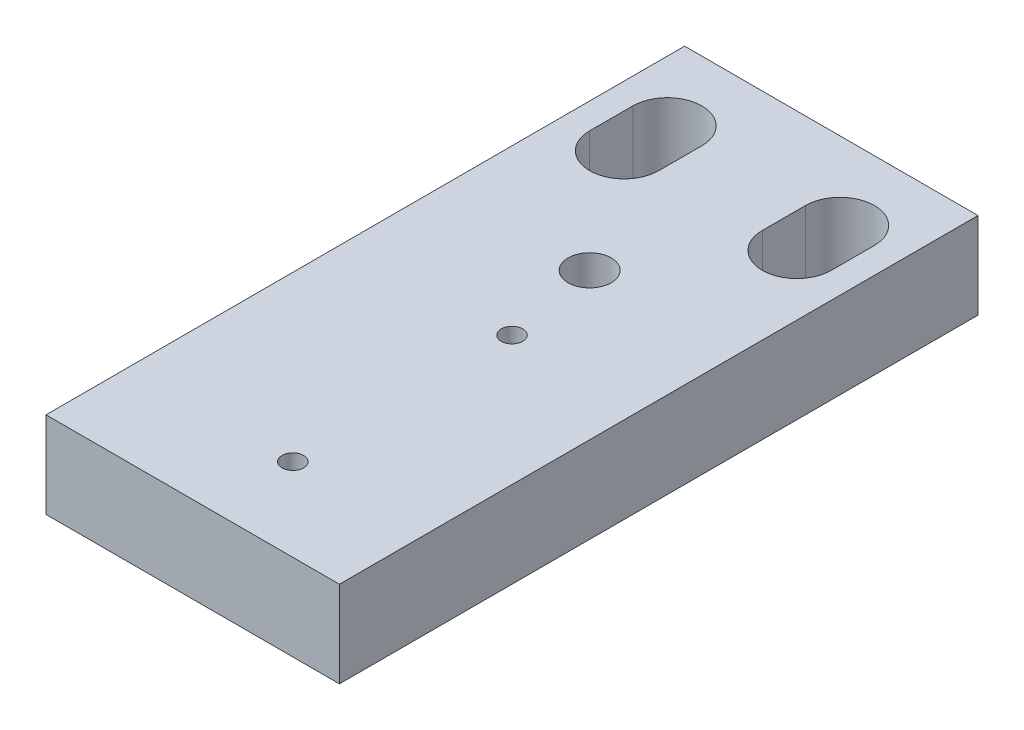
ISO-10303-21;
HEADER;
FILE_DESCRIPTION(('STEP AP214'),'2;1');
FILE_NAME('part.step','',(''),(''),'','','');
FILE_SCHEMA(('AUTOMOTIVE_DESIGN { 1 0 10303 214 1 1 1 1 }'));
ENDSEC;
DATA;
#1=APPLICATION_CONTEXT('core data for automotive mechanical design processes');
#2=APPLICATION_PROTOCOL_DEFINITION('international standard','automotive_design',2000,#1);
#3=PRODUCT_CONTEXT('',#1,'mechanical');
#4=PRODUCT('Part','Part','',(#3));
#5=PRODUCT_RELATED_PRODUCT_CATEGORY('part','',(#4));
#6=PRODUCT_DEFINITION_FORMATION('','',#4);
#7=PRODUCT_DEFINITION_CONTEXT('part definition',#1,'design');
#8=PRODUCT_DEFINITION('design','',#6,#7);
#9=PRODUCT_DEFINITION_SHAPE('','',#8);
#10=(LENGTH_UNIT() NAMED_UNIT(*) SI_UNIT(.MILLI.,.METRE.));
#11=(NAMED_UNIT(*) PLANE_ANGLE_UNIT() SI_UNIT($,.RADIAN.));
#12=(NAMED_UNIT(*) SI_UNIT($,.STERADIAN.) SOLID_ANGLE_UNIT());
#13=UNCERTAINTY_MEASURE_WITH_UNIT(LENGTH_MEASURE(1.E-05),#10,'distance_accuracy_value','');
#14=(GEOMETRIC_REPRESENTATION_CONTEXT(3) GLOBAL_UNCERTAINTY_ASSIGNED_CONTEXT((#13)) GLOBAL_UNIT_ASSIGNED_CONTEXT((#10,
#11,#12)) REPRESENTATION_CONTEXT('',''));
#15=CARTESIAN_POINT('',(0.,0.,0.));
#16=DIRECTION('',(0.,0.,1.));
#17=DIRECTION('',(1.,0.,0.));
#18=AXIS2_PLACEMENT_3D('',#15,#16,#17);
#19=CARTESIAN_POINT('',(0.,10.,0.));
#20=DIRECTION('',(0.,1.,0.));
#21=DIRECTION('',(0.,0.,1.));
#22=AXIS2_PLACEMENT_3D('',#19,#20,#21);
#23=PLANE('',#22);
#24=CARTESIAN_POINT('',(0.,10.,-8.99999999999943));
#25=DIRECTION('',(0.,-1.,0.));
#26=DIRECTION('',(0.,0.,-1.));
#27=AXIS2_PLACEMENT_3D('',#24,#25,#26);
#28=CIRCLE('',#27,2.5);
#29=CARTESIAN_POINT('',(0.,10.,-11.4999999999994));
#30=VERTEX_POINT('',#29);
#31=EDGE_CURVE('P0_E169',#30,#30,#28,.T.);
#32=ORIENTED_EDGE('',*,*,#31,.T.);
#33=EDGE_LOOP('',(#32));
#34=FACE_BOUND('',#33,.T.);
#35=CARTESIAN_POINT('',(2.,10.,2.));
#36=DIRECTION('',(0.,1.,0.));
#37=DIRECTION('',(0.,0.,1.));
#38=AXIS2_PLACEMENT_3D('',#35,#36,#37);
#39=CIRCLE('',#38,1.25);
#40=CARTESIAN_POINT('',(2.,10.,3.25));
#41=VERTEX_POINT('',#40);
#42=EDGE_CURVE('P0_E172',#41,#41,#39,.F.);
#43=ORIENTED_EDGE('',*,*,#42,.T.);
#44=EDGE_LOOP('',(#43));
#45=FACE_BOUND('',#44,.T.);
#46=CARTESIAN_POINT('',(2.,10.,27.4));
#47=DIRECTION('',(0.,1.,0.));
#48=DIRECTION('',(0.,0.,1.));
#49=AXIS2_PLACEMENT_3D('',#46,#47,#48);
#50=CIRCLE('',#49,1.25);
#51=CARTESIAN_POINT('',(2.,10.,28.65));
#52=VERTEX_POINT('',#51);
#53=EDGE_CURVE('P0_E175',#52,#52,#50,.F.);
#54=ORIENTED_EDGE('',*,*,#53,.T.);
#55=EDGE_LOOP('',(#54));
#56=FACE_BOUND('',#55,.T.);
#57=CARTESIAN_POINT('',(10.,10.,-22.9999999999994));
#58=DIRECTION('',(0.,1.,0.));
#59=DIRECTION('',(0.,0.,1.));
#60=AXIS2_PLACEMENT_3D('',#57,#58,#59);
#61=CIRCLE('',#60,4.);
#62=CARTESIAN_POINT('',(14.,10.,-22.9999999999994));
#63=VERTEX_POINT('',#62);
#64=CARTESIAN_POINT('',(6.00000000000001,10.,-22.9999999999994));
#65=VERTEX_POINT('',#64);
#66=EDGE_CURVE('P0_E179',#63,#65,#61,.F.);
#67=ORIENTED_EDGE('',*,*,#66,.T.);
#68=DIRECTION('',(0.,0.,-1.));
#69=VECTOR('',#68,1.);
#70=CARTESIAN_POINT('',(6.00000000000001,10.,-22.9999999999994));
#71=LINE('',#70,#69);
#72=CARTESIAN_POINT('',(6.00000000000001,10.,-27.9999999999994));
#73=VERTEX_POINT('',#72);
#74=EDGE_CURVE('P0_E135',#73,#65,#71,.F.);
#75=ORIENTED_EDGE('',*,*,#74,.F.);
#76=CARTESIAN_POINT('',(10.,10.,-27.9999999999994));
#77=DIRECTION('',(0.,1.,0.));
#78=DIRECTION('',(0.,0.,1.));
#79=AXIS2_PLACEMENT_3D('',#76,#77,#78);
#80=CIRCLE('',#79,4.);
#81=CARTESIAN_POINT('',(14.,10.,-27.9999999999994));
#82=VERTEX_POINT('',#81);
#83=EDGE_CURVE('P0_E142',#73,#82,#80,.F.);
#84=ORIENTED_EDGE('',*,*,#83,.T.);
#85=DIRECTION('',(0.,0.,1.));
#86=VECTOR('',#85,1.);
#87=CARTESIAN_POINT('',(14.,10.,-27.9999999999994));
#88=LINE('',#87,#86);
#89=EDGE_CURVE('P0_E139',#63,#82,#88,.F.);
#90=ORIENTED_EDGE('',*,*,#89,.F.);
#91=EDGE_LOOP('',(#67,#75,#84,#90));
#92=FACE_BOUND('',#91,.T.);
#93=CARTESIAN_POINT('',(-10.,10.,-27.9999999999994));
#94=DIRECTION('',(0.,1.,0.));
#95=DIRECTION('',(0.,0.,1.));
#96=AXIS2_PLACEMENT_3D('',#93,#94,#95);
#97=CIRCLE('',#96,4.);
#98=CARTESIAN_POINT('',(-14.,10.,-27.9999999999994));
#99=VERTEX_POINT('',#98);
#100=CARTESIAN_POINT('',(-6.00000000000001,10.,-27.9999999999994));
#101=VERTEX_POINT('',#100);
#102=EDGE_CURVE('P0_E183',#99,#101,#97,.F.);
#103=ORIENTED_EDGE('',*,*,#102,.T.);
#104=DIRECTION('',(0.,0.,1.));
#105=VECTOR('',#104,1.);
#106=CARTESIAN_POINT('',(-6.00000000000001,10.,-27.9999999999994));
#107=LINE('',#106,#105);
#108=CARTESIAN_POINT('',(-6.00000000000001,10.,-22.9999999999994));
#109=VERTEX_POINT('',#108);
#110=EDGE_CURVE('P0_E85',#109,#101,#107,.F.);
#111=ORIENTED_EDGE('',*,*,#110,.F.);
#112=CARTESIAN_POINT('',(-10.,10.,-22.9999999999994));
#113=DIRECTION('',(0.,1.,0.));
#114=DIRECTION('',(0.,0.,1.));
#115=AXIS2_PLACEMENT_3D('',#112,#113,#114);
#116=CIRCLE('',#115,4.);
#117=CARTESIAN_POINT('',(-14.,10.,-22.9999999999994));
#118=VERTEX_POINT('',#117);
#119=EDGE_CURVE('P0_E19',#109,#118,#116,.F.);
#120=ORIENTED_EDGE('',*,*,#119,.T.);
#121=DIRECTION('',(0.,0.,-1.));
#122=VECTOR('',#121,1.);
#123=CARTESIAN_POINT('',(-14.,10.,-22.9999999999994));
#124=LINE('',#123,#122);
#125=EDGE_CURVE('P0_E146',#99,#118,#124,.F.);
#126=ORIENTED_EDGE('',*,*,#125,.F.);
#127=EDGE_LOOP('',(#103,#111,#120,#126));
#128=FACE_BOUND('',#127,.T.);
#129=DIRECTION('',(-1.,0.,0.));
#130=VECTOR('',#129,1.);
#131=CARTESIAN_POINT('',(17.,10.,-36.9999999999994));
#132=LINE('',#131,#130);
#133=CARTESIAN_POINT('',(-17.,10.,-36.9999999999994));
#134=VERTEX_POINT('',#133);
#135=CARTESIAN_POINT('',(17.,10.,-36.9999999999994));
#136=VERTEX_POINT('',#135);
#137=EDGE_CURVE('P0_E95',#134,#136,#132,.F.);
#138=ORIENTED_EDGE('',*,*,#137,.F.);
#139=DIRECTION('',(0.,0.,1.));
#140=VECTOR('',#139,1.);
#141=CARTESIAN_POINT('',(-17.,10.,-36.9999999999994));
#142=LINE('',#141,#140);
#143=CARTESIAN_POINT('',(-17.,10.,37.));
#144=VERTEX_POINT('',#143);
#145=EDGE_CURVE('P0_E122',#144,#134,#142,.F.);
#146=ORIENTED_EDGE('',*,*,#145,.F.);
#147=DIRECTION('',(1.,0.,0.));
#148=VECTOR('',#147,1.);
#149=CARTESIAN_POINT('',(-17.,10.,37.));
#150=LINE('',#149,#148);
#151=CARTESIAN_POINT('',(17.,10.,37.0000000000011));
#152=VERTEX_POINT('',#151);
#153=EDGE_CURVE('P0_E113',#152,#144,#150,.F.);
#154=ORIENTED_EDGE('',*,*,#153,.F.);
#155=DIRECTION('',(0.,0.,-1.));
#156=VECTOR('',#155,1.);
#157=CARTESIAN_POINT('',(17.,10.,37.0000000000011));
#158=LINE('',#157,#156);
#159=EDGE_CURVE('P0_E107',#136,#152,#158,.F.);
#160=ORIENTED_EDGE('',*,*,#159,.F.);
#161=EDGE_LOOP('',(#138,#146,#154,#160));
#162=FACE_BOUND('',#161,.T.);
#163=ADVANCED_FACE('P0_F16',(#34,#45,#56,#92,#128,#162),#23,.T.);
#164=CARTESIAN_POINT('',(-17.,0.,-36.9999999999994));
#165=DIRECTION('',(-1.,0.,0.));
#166=DIRECTION('',(0.,0.,1.));
#167=AXIS2_PLACEMENT_3D('',#164,#165,#166);
#168=PLANE('',#167);
#169=DIRECTION('',(0.,1.,0.));
#170=VECTOR('',#169,1.);
#171=CARTESIAN_POINT('',(-17.,0.,-36.9999999999994));
#172=LINE('',#171,#170);
#173=CARTESIAN_POINT('',(-17.,0.,-36.9999999999994));
#174=VERTEX_POINT('',#173);
#175=EDGE_CURVE('P0_E199',#174,#134,#172,.T.);
#176=ORIENTED_EDGE('',*,*,#175,.F.);
#177=DIRECTION('',(0.,0.,1.));
#178=VECTOR('',#177,1.);
#179=CARTESIAN_POINT('',(-17.,0.,0.));
#180=LINE('',#179,#178);
#181=CARTESIAN_POINT('',(-17.,0.,37.));
#182=VERTEX_POINT('',#181);
#183=EDGE_CURVE('P0_E130',#174,#182,#180,.T.);
#184=ORIENTED_EDGE('',*,*,#183,.T.);
#185=DIRECTION('',(0.,1.,0.));
#186=VECTOR('',#185,1.);
#187=CARTESIAN_POINT('',(-17.,0.,37.));
#188=LINE('',#187,#186);
#189=EDGE_CURVE('P0_E118',#144,#182,#188,.F.);
#190=ORIENTED_EDGE('',*,*,#189,.F.);
#191=ORIENTED_EDGE('',*,*,#145,.T.);
#192=EDGE_LOOP('',(#176,#184,#190,#191));
#193=FACE_BOUND('',#192,.T.);
#194=ADVANCED_FACE('P0_F128',(#193),#168,.T.);
#195=CARTESIAN_POINT('',(-17.,0.,37.));
#196=DIRECTION('',(0.,0.,1.));
#197=DIRECTION('',(1.,0.,0.));
#198=AXIS2_PLACEMENT_3D('',#195,#196,#197);
#199=PLANE('',#198);
#200=ORIENTED_EDGE('',*,*,#189,.T.);
#201=DIRECTION('',(1.,0.,0.));
#202=VECTOR('',#201,1.);
#203=CARTESIAN_POINT('',(0.,0.,37.));
#204=LINE('',#203,#202);
#205=CARTESIAN_POINT('',(17.,0.,37.0000000000011));
#206=VERTEX_POINT('',#205);
#207=EDGE_CURVE('P0_E209',#182,#206,#204,.T.);
#208=ORIENTED_EDGE('',*,*,#207,.T.);
#209=DIRECTION('',(0.,1.,0.));
#210=VECTOR('',#209,1.);
#211=CARTESIAN_POINT('',(17.,0.,37.0000000000011));
#212=LINE('',#211,#210);
#213=EDGE_CURVE('P0_E120',#152,#206,#212,.F.);
#214=ORIENTED_EDGE('',*,*,#213,.F.);
#215=ORIENTED_EDGE('',*,*,#153,.T.);
#216=EDGE_LOOP('',(#200,#208,#214,#215));
#217=FACE_BOUND('',#216,.T.);
#218=ADVANCED_FACE('P0_F115',(#217),#199,.T.);
#219=CARTESIAN_POINT('',(17.,0.,37.0000000000011));
#220=DIRECTION('',(1.,0.,0.));
#221=DIRECTION('',(0.,0.,-1.));
#222=AXIS2_PLACEMENT_3D('',#219,#220,#221);
#223=PLANE('',#222);
#224=ORIENTED_EDGE('',*,*,#213,.T.);
#225=DIRECTION('',(0.,0.,1.));
#226=VECTOR('',#225,1.);
#227=CARTESIAN_POINT('',(17.,0.,1.13797860024079E-12));
#228=LINE('',#227,#226);
#229=CARTESIAN_POINT('',(17.,0.,-36.9999999999994));
#230=VERTEX_POINT('',#229);
#231=EDGE_CURVE('P0_E204',#206,#230,#228,.F.);
#232=ORIENTED_EDGE('',*,*,#231,.T.);
#233=DIRECTION('',(0.,1.,0.));
#234=VECTOR('',#233,1.);
#235=CARTESIAN_POINT('',(17.,0.,-36.9999999999994));
#236=LINE('',#235,#234);
#237=EDGE_CURVE('P0_E145',#136,#230,#236,.F.);
#238=ORIENTED_EDGE('',*,*,#237,.F.);
#239=ORIENTED_EDGE('',*,*,#159,.T.);
#240=EDGE_LOOP('',(#224,#232,#238,#239));
#241=FACE_BOUND('',#240,.T.);
#242=ADVANCED_FACE('P0_F203',(#241),#223,.T.);
#243=CARTESIAN_POINT('',(17.,0.,-36.9999999999994));
#244=DIRECTION('',(0.,0.,-1.));
#245=DIRECTION('',(-1.,0.,0.));
#246=AXIS2_PLACEMENT_3D('',#243,#244,#245);
#247=PLANE('',#246);
#248=ORIENTED_EDGE('',*,*,#237,.T.);
#249=DIRECTION('',(1.,0.,0.));
#250=VECTOR('',#249,1.);
#251=CARTESIAN_POINT('',(0.,0.,-36.9999999999994));
#252=LINE('',#251,#250);
#253=EDGE_CURVE('P0_E211',#230,#174,#252,.F.);
#254=ORIENTED_EDGE('',*,*,#253,.T.);
#255=ORIENTED_EDGE('',*,*,#175,.T.);
#256=ORIENTED_EDGE('',*,*,#137,.T.);
#257=EDGE_LOOP('',(#248,#254,#255,#256));
#258=FACE_BOUND('',#257,.T.);
#259=ADVANCED_FACE('P0_F240',(#258),#247,.T.);
#260=CARTESIAN_POINT('',(-6.00000000000001,0.,-27.9999999999994));
#261=DIRECTION('',(-1.,0.,0.));
#262=DIRECTION('',(0.,0.,1.));
#263=AXIS2_PLACEMENT_3D('',#260,#261,#262);
#264=PLANE('',#263);
#265=DIRECTION('',(0.,1.,0.));
#266=VECTOR('',#265,1.);
#267=CARTESIAN_POINT('',(-6.00000000000001,0.,-27.9999999999994));
#268=LINE('',#267,#266);
#269=CARTESIAN_POINT('',(-6.00000000000001,0.,-27.9999999999994));
#270=VERTEX_POINT('',#269);
#271=EDGE_CURVE('P0_E138',#101,#270,#268,.F.);
#272=ORIENTED_EDGE('',*,*,#271,.T.);
#273=DIRECTION('',(0.,0.,1.));
#274=VECTOR('',#273,1.);
#275=CARTESIAN_POINT('',(-6.00000000000001,0.,0.));
#276=LINE('',#275,#274);
#277=CARTESIAN_POINT('',(-6.00000000000001,0.,-22.9999999999994));
#278=VERTEX_POINT('',#277);
#279=EDGE_CURVE('P0_E168',#270,#278,#276,.T.);
#280=ORIENTED_EDGE('',*,*,#279,.T.);
#281=DIRECTION('',(0.,1.,0.));
#282=VECTOR('',#281,1.);
#283=CARTESIAN_POINT('',(-6.00000000000001,0.,-22.9999999999994));
#284=LINE('',#283,#282);
#285=EDGE_CURVE('P0_E144',#278,#109,#284,.T.);
#286=ORIENTED_EDGE('',*,*,#285,.T.);
#287=ORIENTED_EDGE('',*,*,#110,.T.);
#288=EDGE_LOOP('',(#272,#280,#286,#287));
#289=FACE_BOUND('',#288,.T.);
#290=ADVANCED_FACE('P0_F243',(#289),#264,.T.);
#291=CARTESIAN_POINT('',(-10.,0.,-22.9999999999994));
#292=DIRECTION('',(0.,1.,0.));
#293=DIRECTION('',(0.,0.,1.));
#294=AXIS2_PLACEMENT_3D('',#291,#292,#293);
#295=CYLINDRICAL_SURFACE('',#294,4.);
#296=ORIENTED_EDGE('',*,*,#119,.F.);
#297=ORIENTED_EDGE('',*,*,#285,.F.);
#298=CARTESIAN_POINT('',(-10.,0.,-22.9999999999994));
#299=DIRECTION('',(0.,1.,0.));
#300=DIRECTION('',(0.,0.,1.));
#301=AXIS2_PLACEMENT_3D('',#298,#299,#300);
#302=CIRCLE('',#301,4.);
#303=CARTESIAN_POINT('',(-14.,0.,-22.9999999999994));
#304=VERTEX_POINT('',#303);
#305=EDGE_CURVE('P0_E165',#278,#304,#302,.F.);
#306=ORIENTED_EDGE('',*,*,#305,.T.);
#307=DIRECTION('',(0.,1.,0.));
#308=VECTOR('',#307,1.);
#309=CARTESIAN_POINT('',(-14.,0.,-22.9999999999994));
#310=LINE('',#309,#308);
#311=EDGE_CURVE('P0_E147',#118,#304,#310,.F.);
#312=ORIENTED_EDGE('',*,*,#311,.F.);
#313=EDGE_LOOP('',(#296,#297,#306,#312));
#314=FACE_BOUND('',#313,.T.);
#315=ADVANCED_FACE('P0_F250',(#314),#295,.F.);
#316=CARTESIAN_POINT('',(-14.,0.,-22.9999999999994));
#317=DIRECTION('',(1.,0.,0.));
#318=DIRECTION('',(0.,0.,-1.));
#319=AXIS2_PLACEMENT_3D('',#316,#317,#318);
#320=PLANE('',#319);
#321=ORIENTED_EDGE('',*,*,#311,.T.);
#322=DIRECTION('',(0.,0.,1.));
#323=VECTOR('',#322,1.);
#324=CARTESIAN_POINT('',(-14.,0.,0.));
#325=LINE('',#324,#323);
#326=CARTESIAN_POINT('',(-14.,0.,-27.9999999999994));
#327=VERTEX_POINT('',#326);
#328=EDGE_CURVE('P0_E164',#304,#327,#325,.F.);
#329=ORIENTED_EDGE('',*,*,#328,.T.);
#330=DIRECTION('',(0.,1.,0.));
#331=VECTOR('',#330,1.);
#332=CARTESIAN_POINT('',(-14.,0.,-27.9999999999994));
#333=LINE('',#332,#331);
#334=EDGE_CURVE('P0_E184',#327,#99,#333,.T.);
#335=ORIENTED_EDGE('',*,*,#334,.T.);
#336=ORIENTED_EDGE('',*,*,#125,.T.);
#337=EDGE_LOOP('',(#321,#329,#335,#336));
#338=FACE_BOUND('',#337,.T.);
#339=ADVANCED_FACE('P0_F287',(#338),#320,.T.);
#340=CARTESIAN_POINT('',(-10.,0.,-27.9999999999994));
#341=DIRECTION('',(0.,1.,0.));
#342=DIRECTION('',(0.,0.,1.));
#343=AXIS2_PLACEMENT_3D('',#340,#341,#342);
#344=CYLINDRICAL_SURFACE('',#343,4.);
#345=ORIENTED_EDGE('',*,*,#102,.F.);
#346=ORIENTED_EDGE('',*,*,#334,.F.);
#347=CARTESIAN_POINT('',(-10.,0.,-27.9999999999994));
#348=DIRECTION('',(0.,1.,0.));
#349=DIRECTION('',(0.,0.,1.));
#350=AXIS2_PLACEMENT_3D('',#347,#348,#349);
#351=CIRCLE('',#350,4.);
#352=EDGE_CURVE('P0_E161',#327,#270,#351,.F.);
#353=ORIENTED_EDGE('',*,*,#352,.T.);
#354=ORIENTED_EDGE('',*,*,#271,.F.);
#355=EDGE_LOOP('',(#345,#346,#353,#354));
#356=FACE_BOUND('',#355,.T.);
#357=ADVANCED_FACE('P0_F284',(#356),#344,.F.);
#358=CARTESIAN_POINT('',(6.00000000000001,0.,-22.9999999999994));
#359=DIRECTION('',(1.,0.,0.));
#360=DIRECTION('',(0.,0.,-1.));
#361=AXIS2_PLACEMENT_3D('',#358,#359,#360);
#362=PLANE('',#361);
#363=DIRECTION('',(0.,1.,0.));
#364=VECTOR('',#363,1.);
#365=CARTESIAN_POINT('',(6.00000000000001,0.,-22.9999999999994));
#366=LINE('',#365,#364);
#367=CARTESIAN_POINT('',(6.00000000000001,0.,-22.9999999999994));
#368=VERTEX_POINT('',#367);
#369=EDGE_CURVE('P0_E178',#65,#368,#366,.F.);
#370=ORIENTED_EDGE('',*,*,#369,.T.);
#371=DIRECTION('',(0.,0.,1.));
#372=VECTOR('',#371,1.);
#373=CARTESIAN_POINT('',(6.00000000000001,0.,0.));
#374=LINE('',#373,#372);
#375=CARTESIAN_POINT('',(6.00000000000001,0.,-27.9999999999994));
#376=VERTEX_POINT('',#375);
#377=EDGE_CURVE('P0_E160',#368,#376,#374,.F.);
#378=ORIENTED_EDGE('',*,*,#377,.T.);
#379=DIRECTION('',(0.,1.,0.));
#380=VECTOR('',#379,1.);
#381=CARTESIAN_POINT('',(6.00000000000001,0.,-27.9999999999994));
#382=LINE('',#381,#380);
#383=EDGE_CURVE('P0_E137',#376,#73,#382,.T.);
#384=ORIENTED_EDGE('',*,*,#383,.T.);
#385=ORIENTED_EDGE('',*,*,#74,.T.);
#386=EDGE_LOOP('',(#370,#378,#384,#385));
#387=FACE_BOUND('',#386,.T.);
#388=ADVANCED_FACE('P0_F223',(#387),#362,.T.);
#389=CARTESIAN_POINT('',(10.,0.,-27.9999999999994));
#390=DIRECTION('',(0.,1.,0.));
#391=DIRECTION('',(0.,0.,1.));
#392=AXIS2_PLACEMENT_3D('',#389,#390,#391);
#393=CYLINDRICAL_SURFACE('',#392,4.);
#394=ORIENTED_EDGE('',*,*,#83,.F.);
#395=ORIENTED_EDGE('',*,*,#383,.F.);
#396=CARTESIAN_POINT('',(10.,0.,-27.9999999999994));
#397=DIRECTION('',(0.,1.,0.));
#398=DIRECTION('',(0.,0.,1.));
#399=AXIS2_PLACEMENT_3D('',#396,#397,#398);
#400=CIRCLE('',#399,4.);
#401=CARTESIAN_POINT('',(14.,0.,-27.9999999999994));
#402=VERTEX_POINT('',#401);
#403=EDGE_CURVE('P0_E157',#376,#402,#400,.F.);
#404=ORIENTED_EDGE('',*,*,#403,.T.);
#405=DIRECTION('',(0.,1.,0.));
#406=VECTOR('',#405,1.);
#407=CARTESIAN_POINT('',(14.,0.,-27.9999999999994));
#408=LINE('',#407,#406);
#409=EDGE_CURVE('P0_E141',#82,#402,#408,.F.);
#410=ORIENTED_EDGE('',*,*,#409,.F.);
#411=EDGE_LOOP('',(#394,#395,#404,#410));
#412=FACE_BOUND('',#411,.T.);
#413=ADVANCED_FACE('P0_F228',(#412),#393,.F.);
#414=CARTESIAN_POINT('',(14.,0.,-27.9999999999994));
#415=DIRECTION('',(-1.,0.,0.));
#416=DIRECTION('',(0.,0.,1.));
#417=AXIS2_PLACEMENT_3D('',#414,#415,#416);
#418=PLANE('',#417);
#419=ORIENTED_EDGE('',*,*,#409,.T.);
#420=DIRECTION('',(0.,0.,1.));
#421=VECTOR('',#420,1.);
#422=CARTESIAN_POINT('',(14.,0.,1.11022302462516E-12));
#423=LINE('',#422,#421);
#424=CARTESIAN_POINT('',(14.,0.,-22.9999999999994));
#425=VERTEX_POINT('',#424);
#426=EDGE_CURVE('P0_E156',#402,#425,#423,.T.);
#427=ORIENTED_EDGE('',*,*,#426,.T.);
#428=DIRECTION('',(0.,1.,0.));
#429=VECTOR('',#428,1.);
#430=CARTESIAN_POINT('',(14.,0.,-22.9999999999994));
#431=LINE('',#430,#429);
#432=EDGE_CURVE('P0_E34',#425,#63,#431,.T.);
#433=ORIENTED_EDGE('',*,*,#432,.T.);
#434=ORIENTED_EDGE('',*,*,#89,.T.);
#435=EDGE_LOOP('',(#419,#427,#433,#434));
#436=FACE_BOUND('',#435,.T.);
#437=ADVANCED_FACE('P0_F277',(#436),#418,.T.);
#438=CARTESIAN_POINT('',(10.,0.,-22.9999999999994));
#439=DIRECTION('',(0.,1.,0.));
#440=DIRECTION('',(0.,0.,1.));
#441=AXIS2_PLACEMENT_3D('',#438,#439,#440);
#442=CYLINDRICAL_SURFACE('',#441,4.);
#443=ORIENTED_EDGE('',*,*,#66,.F.);
#444=ORIENTED_EDGE('',*,*,#432,.F.);
#445=CARTESIAN_POINT('',(10.,0.,-22.9999999999994));
#446=DIRECTION('',(0.,1.,0.));
#447=DIRECTION('',(0.,0.,1.));
#448=AXIS2_PLACEMENT_3D('',#445,#446,#447);
#449=CIRCLE('',#448,4.);
#450=EDGE_CURVE('P0_E154',#425,#368,#449,.F.);
#451=ORIENTED_EDGE('',*,*,#450,.T.);
#452=ORIENTED_EDGE('',*,*,#369,.F.);
#453=EDGE_LOOP('',(#443,#444,#451,#452));
#454=FACE_BOUND('',#453,.T.);
#455=ADVANCED_FACE('P0_F273',(#454),#442,.F.);
#456=CARTESIAN_POINT('',(2.,-1.55,27.4));
#457=DIRECTION('',(0.,1.,0.));
#458=DIRECTION('',(0.,0.,1.));
#459=AXIS2_PLACEMENT_3D('',#456,#457,#458);
#460=CYLINDRICAL_SURFACE('',#459,1.25);
#461=ORIENTED_EDGE('',*,*,#53,.F.);
#462=EDGE_LOOP('',(#461));
#463=FACE_BOUND('',#462,.T.);
#464=CARTESIAN_POINT('',(2.,0.,27.4));
#465=DIRECTION('',(0.,1.,0.));
#466=DIRECTION('',(0.,0.,1.));
#467=AXIS2_PLACEMENT_3D('',#464,#465,#466);
#468=CIRCLE('',#467,1.25);
#469=CARTESIAN_POINT('',(2.,0.,28.65));
#470=VERTEX_POINT('',#469);
#471=EDGE_CURVE('P0_E151',#470,#470,#468,.F.);
#472=ORIENTED_EDGE('',*,*,#471,.T.);
#473=EDGE_LOOP('',(#472));
#474=FACE_BOUND('',#473,.T.);
#475=ADVANCED_FACE('P0_F269',(#463,#474),#460,.F.);
#476=CARTESIAN_POINT('',(2.,-1.55,2.));
#477=DIRECTION('',(0.,1.,0.));
#478=DIRECTION('',(0.,0.,1.));
#479=AXIS2_PLACEMENT_3D('',#476,#477,#478);
#480=CYLINDRICAL_SURFACE('',#479,1.25);
#481=ORIENTED_EDGE('',*,*,#42,.F.);
#482=EDGE_LOOP('',(#481));
#483=FACE_BOUND('',#482,.T.);
#484=CARTESIAN_POINT('',(2.,0.,2.));
#485=DIRECTION('',(0.,1.,0.));
#486=DIRECTION('',(0.,0.,1.));
#487=AXIS2_PLACEMENT_3D('',#484,#485,#486);
#488=CIRCLE('',#487,1.25);
#489=CARTESIAN_POINT('',(2.,0.,3.25));
#490=VERTEX_POINT('',#489);
#491=EDGE_CURVE('P0_E25',#490,#490,#488,.F.);
#492=ORIENTED_EDGE('',*,*,#491,.T.);
#493=EDGE_LOOP('',(#492));
#494=FACE_BOUND('',#493,.T.);
#495=ADVANCED_FACE('P0_F261',(#483,#494),#480,.F.);
#496=CARTESIAN_POINT('',(0.,10.,-8.99999999999943));
#497=DIRECTION('',(0.,-1.,0.));
#498=DIRECTION('',(0.,0.,-1.));
#499=AXIS2_PLACEMENT_3D('',#496,#497,#498);
#500=CYLINDRICAL_SURFACE('',#499,2.5);
#501=ORIENTED_EDGE('',*,*,#31,.F.);
#502=EDGE_LOOP('',(#501));
#503=FACE_BOUND('',#502,.T.);
#504=CARTESIAN_POINT('',(0.,0.,-8.99999999999943));
#505=DIRECTION('',(0.,-1.,0.));
#506=DIRECTION('',(0.,0.,-1.));
#507=AXIS2_PLACEMENT_3D('',#504,#505,#506);
#508=CIRCLE('',#507,2.5);
#509=CARTESIAN_POINT('',(0.,0.,-11.4999999999994));
#510=VERTEX_POINT('',#509);
#511=EDGE_CURVE('P0_E11',#510,#510,#508,.T.);
#512=ORIENTED_EDGE('',*,*,#511,.T.);
#513=EDGE_LOOP('',(#512));
#514=FACE_BOUND('',#513,.T.);
#515=ADVANCED_FACE('P0_F255',(#503,#514),#500,.F.);
#516=CARTESIAN_POINT('',(0.,0.,0.));
#517=DIRECTION('',(0.,1.,0.));
#518=DIRECTION('',(0.,0.,1.));
#519=AXIS2_PLACEMENT_3D('',#516,#517,#518);
#520=PLANE('',#519);
#521=ORIENTED_EDGE('',*,*,#511,.F.);
#522=EDGE_LOOP('',(#521));
#523=FACE_BOUND('',#522,.T.);
#524=ORIENTED_EDGE('',*,*,#491,.F.);
#525=EDGE_LOOP('',(#524));
#526=FACE_BOUND('',#525,.T.);
#527=ORIENTED_EDGE('',*,*,#471,.F.);
#528=EDGE_LOOP('',(#527));
#529=FACE_BOUND('',#528,.T.);
#530=ORIENTED_EDGE('',*,*,#426,.F.);
#531=ORIENTED_EDGE('',*,*,#403,.F.);
#532=ORIENTED_EDGE('',*,*,#377,.F.);
#533=ORIENTED_EDGE('',*,*,#450,.F.);
#534=EDGE_LOOP('',(#530,#531,#532,#533));
#535=FACE_BOUND('',#534,.T.);
#536=ORIENTED_EDGE('',*,*,#328,.F.);
#537=ORIENTED_EDGE('',*,*,#305,.F.);
#538=ORIENTED_EDGE('',*,*,#279,.F.);
#539=ORIENTED_EDGE('',*,*,#352,.F.);
#540=EDGE_LOOP('',(#536,#537,#538,#539));
#541=FACE_BOUND('',#540,.T.);
#542=ORIENTED_EDGE('',*,*,#231,.F.);
#543=ORIENTED_EDGE('',*,*,#207,.F.);
#544=ORIENTED_EDGE('',*,*,#183,.F.);
#545=ORIENTED_EDGE('',*,*,#253,.F.);
#546=EDGE_LOOP('',(#542,#543,#544,#545));
#547=FACE_BOUND('',#546,.T.);
#548=ADVANCED_FACE('P0_F208',(#523,#526,#529,#535,#541,#547),#520,.F.);
#549=CLOSED_SHELL('',(#163,#194,#218,#242,#259,#290,#315,#339,#357,#388,#413,#437,#455,#475,
#495,#515,#548));
#550=MANIFOLD_SOLID_BREP('P0_B1',#549);
#551=CARTESIAN_POINT('',(2.,-1.55,2.));
#552=DIRECTION('',(0.,1.,0.));
#553=DIRECTION('',(0.,0.,1.));
#554=AXIS2_PLACEMENT_3D('',#551,#552,#553);
#555=CYLINDRICAL_SURFACE('',#554,1.5);
#556=CARTESIAN_POINT('',(2.,10.,2.));
#557=DIRECTION('',(0.,1.,0.));
#558=DIRECTION('',(0.,0.,1.));
#559=AXIS2_PLACEMENT_3D('',#556,#557,#558);
#560=CIRCLE('',#559,1.5);
#561=CARTESIAN_POINT('',(2.,10.,3.5));
#562=VERTEX_POINT('',#561);
#563=EDGE_CURVE('P1_E10',#562,#562,#560,.F.);
#564=ORIENTED_EDGE('',*,*,#563,.T.);
#565=EDGE_LOOP('',(#564));
#566=FACE_BOUND('',#565,.T.);
#567=CARTESIAN_POINT('',(2.,0.,2.));
#568=DIRECTION('',(0.,1.,0.));
#569=DIRECTION('',(0.,0.,1.));
#570=AXIS2_PLACEMENT_3D('',#567,#568,#569);
#571=CIRCLE('',#570,1.5);
#572=CARTESIAN_POINT('',(2.,0.,3.5));
#573=VERTEX_POINT('',#572);
#574=EDGE_CURVE('P1_E15',#573,#573,#571,.T.);
#575=ORIENTED_EDGE('',*,*,#574,.T.);
#576=EDGE_LOOP('',(#575));
#577=FACE_BOUND('',#576,.T.);
#578=ADVANCED_FACE('P1_F14',(#566,#577),#555,.T.);
#579=OPEN_SHELL('',(#578));
#580=SHELL_BASED_SURFACE_MODEL('P1_B1',(#579));
#581=CARTESIAN_POINT('',(2.,-1.55,27.4));
#582=DIRECTION('',(0.,1.,0.));
#583=DIRECTION('',(0.,0.,1.));
#584=AXIS2_PLACEMENT_3D('',#581,#582,#583);
#585=CYLINDRICAL_SURFACE('',#584,1.5);
#586=CARTESIAN_POINT('',(2.,10.,27.4));
#587=DIRECTION('',(0.,1.,0.));
#588=DIRECTION('',(0.,0.,1.));
#589=AXIS2_PLACEMENT_3D('',#586,#587,#588);
#590=CIRCLE('',#589,1.5);
#591=CARTESIAN_POINT('',(2.,10.,28.9));
#592=VERTEX_POINT('',#591);
#593=EDGE_CURVE('P2_E10',#592,#592,#590,.F.);
#594=ORIENTED_EDGE('',*,*,#593,.T.);
#595=EDGE_LOOP('',(#594));
#596=FACE_BOUND('',#595,.T.);
#597=CARTESIAN_POINT('',(2.,0.,27.4));
#598=DIRECTION('',(0.,1.,0.));
#599=DIRECTION('',(0.,0.,1.));
#600=AXIS2_PLACEMENT_3D('',#597,#598,#599);
#601=CIRCLE('',#600,1.5);
#602=CARTESIAN_POINT('',(2.,0.,28.9));
#603=VERTEX_POINT('',#602);
#604=EDGE_CURVE('P2_E15',#603,#603,#601,.T.);
#605=ORIENTED_EDGE('',*,*,#604,.T.);
#606=EDGE_LOOP('',(#605));
#607=FACE_BOUND('',#606,.T.);
#608=ADVANCED_FACE('P2_F14',(#596,#607),#585,.T.);
#609=OPEN_SHELL('',(#608));
#610=SHELL_BASED_SURFACE_MODEL('P2_B1',(#609));
#611=ADVANCED_BREP_SHAPE_REPRESENTATION('',(#18,#550),#14);
#612=MANIFOLD_SURFACE_SHAPE_REPRESENTATION('',(#18,#580,#610),#14);
#613=SHAPE_REPRESENTATION('',(#18),#14);
#614=SHAPE_DEFINITION_REPRESENTATION(#9,#613);
#615=SHAPE_REPRESENTATION_RELATIONSHIP('','',#613,#611);
#616=SHAPE_REPRESENTATION_RELATIONSHIP('','',#613,#612);
ENDSEC;
END-ISO-10303-21;
